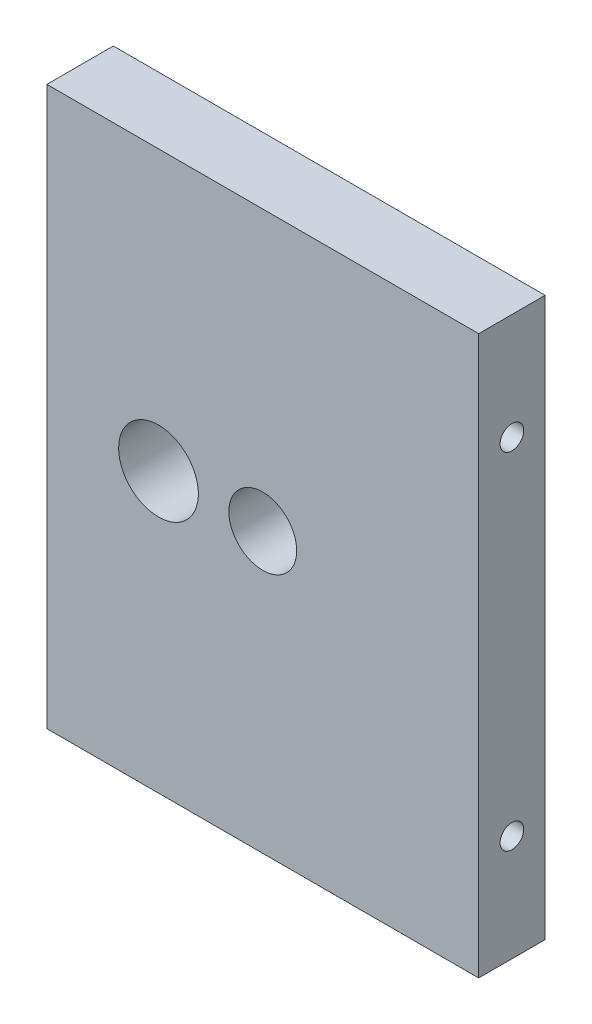
ISO-10303-21;
HEADER;
FILE_DESCRIPTION(('STEP AP214'),'2;1');
FILE_NAME('part.step','',(''),(''),'','','');
FILE_SCHEMA(('AUTOMOTIVE_DESIGN { 1 0 10303 214 1 1 1 1 }'));
ENDSEC;
DATA;
#1=APPLICATION_CONTEXT('core data for automotive mechanical design processes');
#2=APPLICATION_PROTOCOL_DEFINITION('international standard','automotive_design',2000,#1);
#3=PRODUCT_CONTEXT('',#1,'mechanical');
#4=PRODUCT('Part','Part','',(#3));
#5=PRODUCT_RELATED_PRODUCT_CATEGORY('part','',(#4));
#6=PRODUCT_DEFINITION_FORMATION('','',#4);
#7=PRODUCT_DEFINITION_CONTEXT('part definition',#1,'design');
#8=PRODUCT_DEFINITION('design','',#6,#7);
#9=PRODUCT_DEFINITION_SHAPE('','',#8);
#10=(LENGTH_UNIT() NAMED_UNIT(*) SI_UNIT(.MILLI.,.METRE.));
#11=(NAMED_UNIT(*) PLANE_ANGLE_UNIT() SI_UNIT($,.RADIAN.));
#12=(NAMED_UNIT(*) SI_UNIT($,.STERADIAN.) SOLID_ANGLE_UNIT());
#13=UNCERTAINTY_MEASURE_WITH_UNIT(LENGTH_MEASURE(1.E-05),#10,'distance_accuracy_value','');
#14=(GEOMETRIC_REPRESENTATION_CONTEXT(3) GLOBAL_UNCERTAINTY_ASSIGNED_CONTEXT((#13)) GLOBAL_UNIT_ASSIGNED_CONTEXT((#10,
#11,#12)) REPRESENTATION_CONTEXT('',''));
#15=CARTESIAN_POINT('',(0.,0.,0.));
#16=DIRECTION('',(0.,0.,1.));
#17=DIRECTION('',(1.,0.,0.));
#18=AXIS2_PLACEMENT_3D('',#15,#16,#17);
#19=CARTESIAN_POINT('',(0.,0.,5.));
#20=DIRECTION('',(1.,0.,0.));
#21=DIRECTION('',(0.,0.,-1.));
#22=AXIS2_PLACEMENT_3D('',#19,#20,#21);
#23=PLANE('',#22);
#24=CARTESIAN_POINT('',(0.,34.,2.5));
#25=DIRECTION('',(-1.,0.,0.));
#26=DIRECTION('',(0.,0.,1.));
#27=AXIS2_PLACEMENT_3D('',#24,#25,#26);
#28=CIRCLE('',#27,0.889000000000001);
#29=CARTESIAN_POINT('',(0.,34.,3.389));
#30=VERTEX_POINT('',#29);
#31=EDGE_CURVE('E133',#30,#30,#28,.T.);
#32=ORIENTED_EDGE('',*,*,#31,.F.);
#33=EDGE_LOOP('',(#32));
#34=FACE_BOUND('',#33,.T.);
#35=CARTESIAN_POINT('',(0.,8.,2.5));
#36=DIRECTION('',(-1.,0.,0.));
#37=DIRECTION('',(0.,0.,1.));
#38=AXIS2_PLACEMENT_3D('',#35,#36,#37);
#39=CIRCLE('',#38,0.888999999999999);
#40=CARTESIAN_POINT('',(0.,8.,3.389));
#41=VERTEX_POINT('',#40);
#42=EDGE_CURVE('E141',#41,#41,#39,.T.);
#43=ORIENTED_EDGE('',*,*,#42,.F.);
#44=EDGE_LOOP('',(#43));
#45=FACE_BOUND('',#44,.T.);
#46=DIRECTION('',(0.,-1.,0.));
#47=VECTOR('',#46,1.);
#48=CARTESIAN_POINT('',(0.,0.,0.));
#49=LINE('',#48,#47);
#50=CARTESIAN_POINT('',(0.,42.,0.));
#51=VERTEX_POINT('',#50);
#52=CARTESIAN_POINT('',(0.,0.,0.));
#53=VERTEX_POINT('',#52);
#54=EDGE_CURVE('E149',#51,#53,#49,.T.);
#55=ORIENTED_EDGE('',*,*,#54,.T.);
#56=DIRECTION('',(0.,0.,-1.));
#57=VECTOR('',#56,1.);
#58=CARTESIAN_POINT('',(0.,0.,5.));
#59=LINE('',#58,#57);
#60=CARTESIAN_POINT('',(0.,0.,5.));
#61=VERTEX_POINT('',#60);
#62=EDGE_CURVE('E11',#61,#53,#59,.T.);
#63=ORIENTED_EDGE('',*,*,#62,.F.);
#64=DIRECTION('',(0.,-1.,0.));
#65=VECTOR('',#64,1.);
#66=CARTESIAN_POINT('',(0.,0.,5.));
#67=LINE('',#66,#65);
#68=CARTESIAN_POINT('',(0.,42.,5.));
#69=VERTEX_POINT('',#68);
#70=EDGE_CURVE('E150',#69,#61,#67,.T.);
#71=ORIENTED_EDGE('',*,*,#70,.F.);
#72=DIRECTION('',(0.,0.,-1.));
#73=VECTOR('',#72,1.);
#74=CARTESIAN_POINT('',(0.,42.,5.));
#75=LINE('',#74,#73);
#76=EDGE_CURVE('E160',#69,#51,#75,.T.);
#77=ORIENTED_EDGE('',*,*,#76,.T.);
#78=EDGE_LOOP('',(#55,#63,#71,#77));
#79=FACE_BOUND('',#78,.T.);
#80=ADVANCED_FACE('F45',(#34,#45,#79),#23,.F.);
#81=CARTESIAN_POINT('',(0.,0.,5.));
#82=DIRECTION('',(0.,1.,0.));
#83=DIRECTION('',(0.,0.,1.));
#84=AXIS2_PLACEMENT_3D('',#81,#82,#83);
#85=PLANE('',#84);
#86=DIRECTION('',(1.,0.,0.));
#87=VECTOR('',#86,1.);
#88=CARTESIAN_POINT('',(0.,0.,0.));
#89=LINE('',#88,#87);
#90=CARTESIAN_POINT('',(32.5,0.,0.));
#91=VERTEX_POINT('',#90);
#92=EDGE_CURVE('E164',#53,#91,#89,.T.);
#93=ORIENTED_EDGE('',*,*,#92,.T.);
#94=DIRECTION('',(0.,0.,-1.));
#95=VECTOR('',#94,1.);
#96=CARTESIAN_POINT('',(32.5,0.,5.));
#97=LINE('',#96,#95);
#98=CARTESIAN_POINT('',(32.5,0.,5.));
#99=VERTEX_POINT('',#98);
#100=EDGE_CURVE('E54',#99,#91,#97,.T.);
#101=ORIENTED_EDGE('',*,*,#100,.F.);
#102=DIRECTION('',(1.,0.,0.));
#103=VECTOR('',#102,1.);
#104=CARTESIAN_POINT('',(0.,0.,5.));
#105=LINE('',#104,#103);
#106=EDGE_CURVE('E93',#61,#99,#105,.T.);
#107=ORIENTED_EDGE('',*,*,#106,.F.);
#108=ORIENTED_EDGE('',*,*,#62,.T.);
#109=EDGE_LOOP('',(#93,#101,#107,#108));
#110=FACE_BOUND('',#109,.T.);
#111=ADVANCED_FACE('F194',(#110),#85,.F.);
#112=CARTESIAN_POINT('',(32.5,0.,5.));
#113=DIRECTION('',(-1.,0.,0.));
#114=DIRECTION('',(0.,0.,1.));
#115=AXIS2_PLACEMENT_3D('',#112,#113,#114);
#116=PLANE('',#115);
#117=CARTESIAN_POINT('',(32.5,34.,2.5));
#118=DIRECTION('',(1.,0.,0.));
#119=DIRECTION('',(0.,0.,-1.));
#120=AXIS2_PLACEMENT_3D('',#117,#118,#119);
#121=CIRCLE('',#120,0.888999999999987);
#122=CARTESIAN_POINT('',(32.5,34.,1.61100000000001));
#123=VERTEX_POINT('',#122);
#124=EDGE_CURVE('E118',#123,#123,#121,.T.);
#125=ORIENTED_EDGE('',*,*,#124,.F.);
#126=EDGE_LOOP('',(#125));
#127=FACE_BOUND('',#126,.T.);
#128=CARTESIAN_POINT('',(32.5,8.,2.5));
#129=DIRECTION('',(1.,0.,0.));
#130=DIRECTION('',(0.,0.,-1.));
#131=AXIS2_PLACEMENT_3D('',#128,#129,#130);
#132=CIRCLE('',#131,0.888999999999989);
#133=CARTESIAN_POINT('',(32.5,8.,1.61100000000001));
#134=VERTEX_POINT('',#133);
#135=EDGE_CURVE('E117',#134,#134,#132,.T.);
#136=ORIENTED_EDGE('',*,*,#135,.F.);
#137=EDGE_LOOP('',(#136));
#138=FACE_BOUND('',#137,.T.);
#139=DIRECTION('',(0.,1.,0.));
#140=VECTOR('',#139,1.);
#141=CARTESIAN_POINT('',(32.5,0.,0.));
#142=LINE('',#141,#140);
#143=CARTESIAN_POINT('',(32.5,42.,0.));
#144=VERTEX_POINT('',#143);
#145=EDGE_CURVE('E80',#91,#144,#142,.T.);
#146=ORIENTED_EDGE('',*,*,#145,.T.);
#147=DIRECTION('',(0.,0.,-1.));
#148=VECTOR('',#147,1.);
#149=CARTESIAN_POINT('',(32.5,42.,5.));
#150=LINE('',#149,#148);
#151=CARTESIAN_POINT('',(32.5,42.,5.));
#152=VERTEX_POINT('',#151);
#153=EDGE_CURVE('E173',#152,#144,#150,.T.);
#154=ORIENTED_EDGE('',*,*,#153,.F.);
#155=DIRECTION('',(0.,1.,0.));
#156=VECTOR('',#155,1.);
#157=CARTESIAN_POINT('',(32.5,0.,5.));
#158=LINE('',#157,#156);
#159=EDGE_CURVE('E155',#99,#152,#158,.T.);
#160=ORIENTED_EDGE('',*,*,#159,.F.);
#161=ORIENTED_EDGE('',*,*,#100,.T.);
#162=EDGE_LOOP('',(#146,#154,#160,#161));
#163=FACE_BOUND('',#162,.T.);
#164=ADVANCED_FACE('F177',(#127,#138,#163),#116,.F.);
#165=CARTESIAN_POINT('',(0.,42.,5.));
#166=DIRECTION('',(0.,-1.,0.));
#167=DIRECTION('',(0.,0.,-1.));
#168=AXIS2_PLACEMENT_3D('',#165,#166,#167);
#169=PLANE('',#168);
#170=DIRECTION('',(-1.,0.,0.));
#171=VECTOR('',#170,1.);
#172=CARTESIAN_POINT('',(0.,42.,0.));
#173=LINE('',#172,#171);
#174=EDGE_CURVE('E86',#144,#51,#173,.T.);
#175=ORIENTED_EDGE('',*,*,#174,.T.);
#176=ORIENTED_EDGE('',*,*,#76,.F.);
#177=DIRECTION('',(-1.,0.,0.));
#178=VECTOR('',#177,1.);
#179=CARTESIAN_POINT('',(0.,42.,5.));
#180=LINE('',#179,#178);
#181=EDGE_CURVE('E62',#152,#69,#180,.T.);
#182=ORIENTED_EDGE('',*,*,#181,.F.);
#183=ORIENTED_EDGE('',*,*,#153,.T.);
#184=EDGE_LOOP('',(#175,#176,#182,#183));
#185=FACE_BOUND('',#184,.T.);
#186=ADVANCED_FACE('F184',(#185),#169,.F.);
#187=CARTESIAN_POINT('',(0.,0.,5.));
#188=DIRECTION('',(0.,0.,-1.));
#189=DIRECTION('',(-1.,0.,0.));
#190=AXIS2_PLACEMENT_3D('',#187,#188,#189);
#191=PLANE('',#190);
#192=CARTESIAN_POINT('',(16.25,21.,5.));
#193=DIRECTION('',(0.,0.,-1.));
#194=DIRECTION('',(-1.,0.,0.));
#195=AXIS2_PLACEMENT_3D('',#192,#193,#194);
#196=CIRCLE('',#195,2.5527);
#197=CARTESIAN_POINT('',(13.6973,21.,5.));
#198=VERTEX_POINT('',#197);
#199=EDGE_CURVE('E237',#198,#198,#196,.T.);
#200=ORIENTED_EDGE('',*,*,#199,.T.);
#201=EDGE_LOOP('',(#200));
#202=FACE_BOUND('',#201,.T.);
#203=CARTESIAN_POINT('',(8.4,21.,5.));
#204=DIRECTION('',(0.,0.,-1.));
#205=DIRECTION('',(-1.,0.,0.));
#206=AXIS2_PLACEMENT_3D('',#203,#204,#205);
#207=CIRCLE('',#206,3.);
#208=CARTESIAN_POINT('',(5.4,21.,5.));
#209=VERTEX_POINT('',#208);
#210=EDGE_CURVE('E126',#209,#209,#207,.T.);
#211=ORIENTED_EDGE('',*,*,#210,.T.);
#212=EDGE_LOOP('',(#211));
#213=FACE_BOUND('',#212,.T.);
#214=ORIENTED_EDGE('',*,*,#70,.T.);
#215=ORIENTED_EDGE('',*,*,#106,.T.);
#216=ORIENTED_EDGE('',*,*,#159,.T.);
#217=ORIENTED_EDGE('',*,*,#181,.T.);
#218=EDGE_LOOP('',(#214,#215,#216,#217));
#219=FACE_BOUND('',#218,.T.);
#220=ADVANCED_FACE('F186',(#202,#213,#219),#191,.F.);
#221=CARTESIAN_POINT('',(0.,0.,0.));
#222=DIRECTION('',(0.,0.,-1.));
#223=DIRECTION('',(-1.,0.,0.));
#224=AXIS2_PLACEMENT_3D('',#221,#222,#223);
#225=PLANE('',#224);
#226=CARTESIAN_POINT('',(16.25,21.,0.));
#227=DIRECTION('',(0.,0.,-1.));
#228=DIRECTION('',(-1.,0.,0.));
#229=AXIS2_PLACEMENT_3D('',#226,#227,#228);
#230=CIRCLE('',#229,2.55269999999999);
#231=CARTESIAN_POINT('',(13.6973,21.,0.));
#232=VERTEX_POINT('',#231);
#233=EDGE_CURVE('E231',#232,#232,#230,.T.);
#234=ORIENTED_EDGE('',*,*,#233,.F.);
#235=EDGE_LOOP('',(#234));
#236=FACE_BOUND('',#235,.T.);
#237=CARTESIAN_POINT('',(8.4,21.,0.));
#238=DIRECTION('',(0.,0.,-1.));
#239=DIRECTION('',(-1.,0.,0.));
#240=AXIS2_PLACEMENT_3D('',#237,#238,#239);
#241=CIRCLE('',#240,3.);
#242=CARTESIAN_POINT('',(5.4,21.,0.));
#243=VERTEX_POINT('',#242);
#244=EDGE_CURVE('E234',#243,#243,#241,.T.);
#245=ORIENTED_EDGE('',*,*,#244,.F.);
#246=EDGE_LOOP('',(#245));
#247=FACE_BOUND('',#246,.T.);
#248=ORIENTED_EDGE('',*,*,#54,.F.);
#249=ORIENTED_EDGE('',*,*,#174,.F.);
#250=ORIENTED_EDGE('',*,*,#145,.F.);
#251=ORIENTED_EDGE('',*,*,#92,.F.);
#252=EDGE_LOOP('',(#248,#249,#250,#251));
#253=FACE_BOUND('',#252,.T.);
#254=ADVANCED_FACE('F180',(#236,#247,#253),#225,.T.);
#255=CARTESIAN_POINT('',(7.4658349096845,8.,2.5));
#256=DIRECTION('',(-1.,0.,0.));
#257=DIRECTION('',(0.,0.,1.));
#258=AXIS2_PLACEMENT_3D('',#255,#256,#257);
#259=CONICAL_SURFACE('',#258,0.888999999999999,1.02974425867665);
#260=CARTESIAN_POINT('',(8.,8.,2.5));
#261=VERTEX_POINT('',#260);
#262=VERTEX_LOOP('',#261);
#263=FACE_BOUND('',#262,.T.);
#264=CARTESIAN_POINT('',(7.4658349096845,8.,2.5));
#265=DIRECTION('',(-1.,0.,0.));
#266=DIRECTION('',(0.,0.,1.));
#267=AXIS2_PLACEMENT_3D('',#264,#265,#266);
#268=CIRCLE('',#267,0.888999999999999);
#269=CARTESIAN_POINT('',(7.4658349096845,8.,3.389));
#270=VERTEX_POINT('',#269);
#271=EDGE_CURVE('E145',#270,#270,#268,.T.);
#272=ORIENTED_EDGE('',*,*,#271,.T.);
#273=EDGE_LOOP('',(#272));
#274=FACE_BOUND('',#273,.T.);
#275=ADVANCED_FACE('F210',(#263,#274),#259,.F.);
#276=CARTESIAN_POINT('',(0.,8.,2.5));
#277=DIRECTION('',(-1.,0.,0.));
#278=DIRECTION('',(0.,0.,1.));
#279=AXIS2_PLACEMENT_3D('',#276,#277,#278);
#280=CYLINDRICAL_SURFACE('',#279,0.888999999999999);
#281=ORIENTED_EDGE('',*,*,#271,.F.);
#282=EDGE_LOOP('',(#281));
#283=FACE_BOUND('',#282,.T.);
#284=ORIENTED_EDGE('',*,*,#42,.T.);
#285=EDGE_LOOP('',(#284));
#286=FACE_BOUND('',#285,.T.);
#287=ADVANCED_FACE('F207',(#283,#286),#280,.F.);
#288=CARTESIAN_POINT('',(7.4658349096845,34.,2.5));
#289=DIRECTION('',(-1.,0.,0.));
#290=DIRECTION('',(0.,0.,1.));
#291=AXIS2_PLACEMENT_3D('',#288,#289,#290);
#292=CONICAL_SURFACE('',#291,0.889000000000001,1.02974425867665);
#293=CARTESIAN_POINT('',(8.,34.,2.5));
#294=VERTEX_POINT('',#293);
#295=VERTEX_LOOP('',#294);
#296=FACE_BOUND('',#295,.T.);
#297=CARTESIAN_POINT('',(7.4658349096845,34.,2.5));
#298=DIRECTION('',(-1.,0.,0.));
#299=DIRECTION('',(0.,0.,1.));
#300=AXIS2_PLACEMENT_3D('',#297,#298,#299);
#301=CIRCLE('',#300,0.889000000000001);
#302=CARTESIAN_POINT('',(7.4658349096845,34.,3.389));
#303=VERTEX_POINT('',#302);
#304=EDGE_CURVE('E137',#303,#303,#301,.T.);
#305=ORIENTED_EDGE('',*,*,#304,.T.);
#306=EDGE_LOOP('',(#305));
#307=FACE_BOUND('',#306,.T.);
#308=ADVANCED_FACE('F209',(#296,#307),#292,.F.);
#309=CARTESIAN_POINT('',(0.,34.,2.5));
#310=DIRECTION('',(-1.,0.,0.));
#311=DIRECTION('',(0.,0.,1.));
#312=AXIS2_PLACEMENT_3D('',#309,#310,#311);
#313=CYLINDRICAL_SURFACE('',#312,0.889000000000001);
#314=ORIENTED_EDGE('',*,*,#304,.F.);
#315=EDGE_LOOP('',(#314));
#316=FACE_BOUND('',#315,.T.);
#317=ORIENTED_EDGE('',*,*,#31,.T.);
#318=EDGE_LOOP('',(#317));
#319=FACE_BOUND('',#318,.T.);
#320=ADVANCED_FACE('F217',(#316,#319),#313,.F.);
#321=CARTESIAN_POINT('',(25.0341650903155,8.,2.5));
#322=DIRECTION('',(1.,0.,0.));
#323=DIRECTION('',(0.,0.,-1.));
#324=AXIS2_PLACEMENT_3D('',#321,#322,#323);
#325=CONICAL_SURFACE('',#324,0.888999999999999,1.02974425867665);
#326=CARTESIAN_POINT('',(24.5,8.,2.5));
#327=VERTEX_POINT('',#326);
#328=VERTEX_LOOP('',#327);
#329=FACE_BOUND('',#328,.T.);
#330=CARTESIAN_POINT('',(25.0341650903155,8.,2.5));
#331=DIRECTION('',(1.,0.,0.));
#332=DIRECTION('',(0.,0.,-1.));
#333=AXIS2_PLACEMENT_3D('',#330,#331,#332);
#334=CIRCLE('',#333,0.888999999999999);
#335=CARTESIAN_POINT('',(25.0341650903155,8.,1.611));
#336=VERTEX_POINT('',#335);
#337=EDGE_CURVE('E123',#336,#336,#334,.T.);
#338=ORIENTED_EDGE('',*,*,#337,.T.);
#339=EDGE_LOOP('',(#338));
#340=FACE_BOUND('',#339,.T.);
#341=ADVANCED_FACE('F263',(#329,#340),#325,.F.);
#342=CARTESIAN_POINT('',(32.5,8.,2.5));
#343=DIRECTION('',(1.,0.,0.));
#344=DIRECTION('',(0.,0.,-1.));
#345=AXIS2_PLACEMENT_3D('',#342,#343,#344);
#346=CYLINDRICAL_SURFACE('',#345,0.888999999999994);
#347=ORIENTED_EDGE('',*,*,#337,.F.);
#348=EDGE_LOOP('',(#347));
#349=FACE_BOUND('',#348,.T.);
#350=ORIENTED_EDGE('',*,*,#135,.T.);
#351=EDGE_LOOP('',(#350));
#352=FACE_BOUND('',#351,.T.);
#353=ADVANCED_FACE('F110',(#349,#352),#346,.F.);
#354=CARTESIAN_POINT('',(25.0341650903155,34.,2.5));
#355=DIRECTION('',(1.,0.,0.));
#356=DIRECTION('',(0.,0.,-1.));
#357=AXIS2_PLACEMENT_3D('',#354,#355,#356);
#358=CONICAL_SURFACE('',#357,0.889000000000001,1.02974425867665);
#359=CARTESIAN_POINT('',(24.5,34.,2.5));
#360=VERTEX_POINT('',#359);
#361=VERTEX_LOOP('',#360);
#362=FACE_BOUND('',#361,.T.);
#363=CARTESIAN_POINT('',(25.0341650903155,34.,2.5));
#364=DIRECTION('',(1.,0.,0.));
#365=DIRECTION('',(0.,0.,-1.));
#366=AXIS2_PLACEMENT_3D('',#363,#364,#365);
#367=CIRCLE('',#366,0.889000000000001);
#368=CARTESIAN_POINT('',(25.0341650903155,34.,1.611));
#369=VERTEX_POINT('',#368);
#370=EDGE_CURVE('E114',#369,#369,#367,.T.);
#371=ORIENTED_EDGE('',*,*,#370,.T.);
#372=EDGE_LOOP('',(#371));
#373=FACE_BOUND('',#372,.T.);
#374=ADVANCED_FACE('F106',(#362,#373),#358,.F.);
#375=CARTESIAN_POINT('',(32.5,34.,2.5));
#376=DIRECTION('',(1.,0.,0.));
#377=DIRECTION('',(0.,0.,-1.));
#378=AXIS2_PLACEMENT_3D('',#375,#376,#377);
#379=CYLINDRICAL_SURFACE('',#378,0.888999999999994);
#380=ORIENTED_EDGE('',*,*,#370,.F.);
#381=EDGE_LOOP('',(#380));
#382=FACE_BOUND('',#381,.T.);
#383=ORIENTED_EDGE('',*,*,#124,.T.);
#384=EDGE_LOOP('',(#383));
#385=FACE_BOUND('',#384,.T.);
#386=ADVANCED_FACE('F109',(#382,#385),#379,.F.);
#387=CARTESIAN_POINT('',(8.4,21.,5.));
#388=DIRECTION('',(0.,0.,-1.));
#389=DIRECTION('',(-1.,0.,0.));
#390=AXIS2_PLACEMENT_3D('',#387,#388,#389);
#391=CYLINDRICAL_SURFACE('',#390,3.);
#392=ORIENTED_EDGE('',*,*,#210,.F.);
#393=EDGE_LOOP('',(#392));
#394=FACE_BOUND('',#393,.T.);
#395=ORIENTED_EDGE('',*,*,#244,.T.);
#396=EDGE_LOOP('',(#395));
#397=FACE_BOUND('',#396,.T.);
#398=ADVANCED_FACE('F249',(#394,#397),#391,.F.);
#399=CARTESIAN_POINT('',(16.25,21.,0.));
#400=DIRECTION('',(0.,0.,-1.));
#401=DIRECTION('',(-1.,0.,0.));
#402=AXIS2_PLACEMENT_3D('',#399,#400,#401);
#403=CYLINDRICAL_SURFACE('',#402,2.55269999999999);
#404=ORIENTED_EDGE('',*,*,#199,.F.);
#405=EDGE_LOOP('',(#404));
#406=FACE_BOUND('',#405,.T.);
#407=ORIENTED_EDGE('',*,*,#233,.T.);
#408=EDGE_LOOP('',(#407));
#409=FACE_BOUND('',#408,.T.);
#410=ADVANCED_FACE('F247',(#406,#409),#403,.F.);
#411=CLOSED_SHELL('',(#80,#111,#164,#186,#220,#254,#275,#287,#308,#320,#341,#353,#374,#386,#398,#410));
#412=MANIFOLD_SOLID_BREP('B2',#411);
#413=ADVANCED_BREP_SHAPE_REPRESENTATION('',(#18,#412),#14);
#414=SHAPE_DEFINITION_REPRESENTATION(#9,#413);
ENDSEC;
END-ISO-10303-21;
